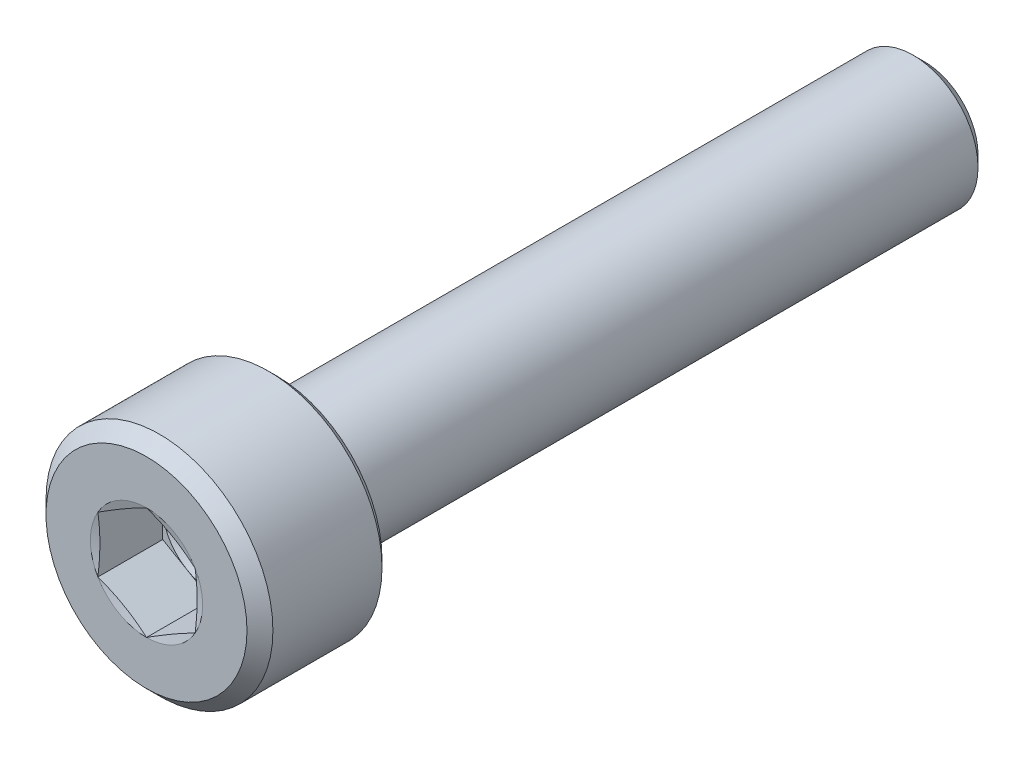
ISO-10303-21;
HEADER;
FILE_DESCRIPTION(('STEP AP214'),'2;1');
FILE_NAME('part.step','',(''),(''),'','','');
FILE_SCHEMA(('AUTOMOTIVE_DESIGN { 1 0 10303 214 1 1 1 1 }'));
ENDSEC;
DATA;
#1=APPLICATION_CONTEXT('core data for automotive mechanical design processes');
#2=APPLICATION_PROTOCOL_DEFINITION('international standard','automotive_design',2000,#1);
#3=PRODUCT_CONTEXT('',#1,'mechanical');
#4=PRODUCT('Part','Part','',(#3));
#5=PRODUCT_RELATED_PRODUCT_CATEGORY('part','',(#4));
#6=PRODUCT_DEFINITION_FORMATION('','',#4);
#7=PRODUCT_DEFINITION_CONTEXT('part definition',#1,'design');
#8=PRODUCT_DEFINITION('design','',#6,#7);
#9=PRODUCT_DEFINITION_SHAPE('','',#8);
#10=(LENGTH_UNIT() NAMED_UNIT(*) SI_UNIT(.MILLI.,.METRE.));
#11=(NAMED_UNIT(*) PLANE_ANGLE_UNIT() SI_UNIT($,.RADIAN.));
#12=(NAMED_UNIT(*) SI_UNIT($,.STERADIAN.) SOLID_ANGLE_UNIT());
#13=UNCERTAINTY_MEASURE_WITH_UNIT(LENGTH_MEASURE(1.E-05),#10,'distance_accuracy_value','');
#14=(GEOMETRIC_REPRESENTATION_CONTEXT(3) GLOBAL_UNCERTAINTY_ASSIGNED_CONTEXT((#13)) GLOBAL_UNIT_ASSIGNED_CONTEXT((#10,
#11,#12)) REPRESENTATION_CONTEXT('',''));
#15=CARTESIAN_POINT('',(0.,0.,0.));
#16=DIRECTION('',(0.,0.,1.));
#17=DIRECTION('',(1.,0.,0.));
#18=AXIS2_PLACEMENT_3D('',#15,#16,#17);
#19=CARTESIAN_POINT('',(0.,0.,0.));
#20=DIRECTION('',(0.,0.,-1.));
#21=DIRECTION('',(-1.,0.,0.));
#22=AXIS2_PLACEMENT_3D('',#19,#20,#21);
#23=PLANE('',#22);
#24=CARTESIAN_POINT('',(0.,0.,0.));
#25=DIRECTION('',(0.,0.,1.));
#26=DIRECTION('',(1.,0.,0.));
#27=AXIS2_PLACEMENT_3D('',#24,#25,#26);
#28=CIRCLE('',#27,3.1);
#29=CARTESIAN_POINT('',(3.1,0.,0.));
#30=VERTEX_POINT('',#29);
#31=EDGE_CURVE('E229',#30,#30,#28,.T.);
#32=ORIENTED_EDGE('',*,*,#31,.T.);
#33=EDGE_LOOP('',(#32));
#34=FACE_BOUND('',#33,.T.);
#35=CARTESIAN_POINT('',(0.,0.,0.));
#36=DIRECTION('',(0.,0.,1.));
#37=DIRECTION('',(1.,0.,0.));
#38=AXIS2_PLACEMENT_3D('',#35,#36,#37);
#39=CIRCLE('',#38,1.73205080756888);
#40=CARTESIAN_POINT('',(-1.5,-0.866025403784441,0.));
#41=VERTEX_POINT('',#40);
#42=CARTESIAN_POINT('',(0.,-1.73205080756888,0.));
#43=VERTEX_POINT('',#42);
#44=EDGE_CURVE('E155',#41,#43,#39,.T.);
#45=ORIENTED_EDGE('',*,*,#44,.F.);
#46=CARTESIAN_POINT('',(-1.5,0.86602540378444,0.));
#47=VERTEX_POINT('',#46);
#48=EDGE_CURVE('E154',#47,#41,#39,.T.);
#49=ORIENTED_EDGE('',*,*,#48,.F.);
#50=CARTESIAN_POINT('',(0.,1.73205080756888,0.));
#51=VERTEX_POINT('',#50);
#52=EDGE_CURVE('E121',#51,#47,#39,.T.);
#53=ORIENTED_EDGE('',*,*,#52,.F.);
#54=CARTESIAN_POINT('',(1.5,0.86602540378444,0.));
#55=VERTEX_POINT('',#54);
#56=EDGE_CURVE('E115',#55,#51,#39,.T.);
#57=ORIENTED_EDGE('',*,*,#56,.F.);
#58=CARTESIAN_POINT('',(1.5,-0.866025403784438,0.));
#59=VERTEX_POINT('',#58);
#60=EDGE_CURVE('E123',#59,#55,#39,.T.);
#61=ORIENTED_EDGE('',*,*,#60,.F.);
#62=EDGE_CURVE('E313',#43,#59,#39,.T.);
#63=ORIENTED_EDGE('',*,*,#62,.F.);
#64=EDGE_LOOP('',(#45,#49,#53,#57,#61,#63));
#65=FACE_BOUND('',#64,.T.);
#66=ADVANCED_FACE('F38',(#34,#65),#23,.F.);
#67=CARTESIAN_POINT('',(0.,0.,-0.4));
#68=DIRECTION('',(0.,0.,-1.));
#69=DIRECTION('',(-1.,0.,0.));
#70=AXIS2_PLACEMENT_3D('',#67,#68,#69);
#71=CONICAL_SURFACE('',#70,3.5,0.78539816339745);
#72=ORIENTED_EDGE('',*,*,#31,.F.);
#73=EDGE_LOOP('',(#72));
#74=FACE_BOUND('',#73,.T.);
#75=CARTESIAN_POINT('',(0.,0.,-0.4));
#76=DIRECTION('',(0.,0.,1.));
#77=DIRECTION('',(1.,0.,0.));
#78=AXIS2_PLACEMENT_3D('',#75,#76,#77);
#79=CIRCLE('',#78,3.5);
#80=CARTESIAN_POINT('',(3.5,0.,-0.4));
#81=VERTEX_POINT('',#80);
#82=EDGE_CURVE('E231',#81,#81,#79,.T.);
#83=ORIENTED_EDGE('',*,*,#82,.T.);
#84=EDGE_LOOP('',(#83));
#85=FACE_BOUND('',#84,.T.);
#86=ADVANCED_FACE('F220',(#74,#85),#71,.T.);
#87=CARTESIAN_POINT('',(0.,0.,0.));
#88=DIRECTION('',(0.,0.,1.));
#89=DIRECTION('',(1.,0.,0.));
#90=AXIS2_PLACEMENT_3D('',#87,#88,#89);
#91=CYLINDRICAL_SURFACE('',#90,3.5);
#92=ORIENTED_EDGE('',*,*,#82,.F.);
#93=EDGE_LOOP('',(#92));
#94=FACE_BOUND('',#93,.T.);
#95=CARTESIAN_POINT('',(0.,0.,-3.765));
#96=DIRECTION('',(0.,0.,1.));
#97=DIRECTION('',(1.,0.,0.));
#98=AXIS2_PLACEMENT_3D('',#95,#96,#97);
#99=CIRCLE('',#98,3.5);
#100=CARTESIAN_POINT('',(3.5,0.,-3.765));
#101=VERTEX_POINT('',#100);
#102=EDGE_CURVE('E234',#101,#101,#99,.T.);
#103=ORIENTED_EDGE('',*,*,#102,.T.);
#104=EDGE_LOOP('',(#103));
#105=FACE_BOUND('',#104,.T.);
#106=ADVANCED_FACE('F225',(#94,#105),#91,.T.);
#107=CARTESIAN_POINT('',(0.,0.,-4.));
#108=DIRECTION('',(0.,0.,1.));
#109=DIRECTION('',(1.,0.,0.));
#110=AXIS2_PLACEMENT_3D('',#107,#108,#109);
#111=CONICAL_SURFACE('',#110,3.265,0.78539816339745);
#112=ORIENTED_EDGE('',*,*,#102,.F.);
#113=EDGE_LOOP('',(#112));
#114=FACE_BOUND('',#113,.T.);
#115=CARTESIAN_POINT('',(0.,0.,-4.));
#116=DIRECTION('',(0.,0.,1.));
#117=DIRECTION('',(1.,0.,0.));
#118=AXIS2_PLACEMENT_3D('',#115,#116,#117);
#119=CIRCLE('',#118,3.265);
#120=CARTESIAN_POINT('',(3.265,0.,-4.));
#121=VERTEX_POINT('',#120);
#122=EDGE_CURVE('E239',#121,#121,#119,.T.);
#123=ORIENTED_EDGE('',*,*,#122,.T.);
#124=EDGE_LOOP('',(#123));
#125=FACE_BOUND('',#124,.T.);
#126=ADVANCED_FACE('F429',(#114,#125),#111,.T.);
#127=CARTESIAN_POINT('',(0.,3.265,-4.));
#128=DIRECTION('',(0.,0.,1.));
#129=DIRECTION('',(1.,0.,0.));
#130=AXIS2_PLACEMENT_3D('',#127,#128,#129);
#131=PLANE('',#130);
#132=ORIENTED_EDGE('',*,*,#122,.F.);
#133=EDGE_LOOP('',(#132));
#134=FACE_BOUND('',#133,.T.);
#135=CARTESIAN_POINT('',(0.,0.,-4.));
#136=DIRECTION('',(0.,0.,1.));
#137=DIRECTION('',(1.,0.,0.));
#138=AXIS2_PLACEMENT_3D('',#135,#136,#137);
#139=CIRCLE('',#138,2.35);
#140=CARTESIAN_POINT('',(2.35,0.,-4.));
#141=VERTEX_POINT('',#140);
#142=EDGE_CURVE('E242',#141,#141,#139,.T.);
#143=ORIENTED_EDGE('',*,*,#142,.T.);
#144=EDGE_LOOP('',(#143));
#145=FACE_BOUND('',#144,.T.);
#146=ADVANCED_FACE('F421',(#134,#145),#131,.F.);
#147=CARTESIAN_POINT('',(0.,0.,-4.2));
#148=DIRECTION('',(0.,0.,1.));
#149=DIRECTION('',(1.,0.,0.));
#150=AXIS2_PLACEMENT_3D('',#147,#148,#149);
#151=TOROIDAL_SURFACE('',#150,2.35,0.199999999999999);
#152=ORIENTED_EDGE('',*,*,#142,.F.);
#153=EDGE_LOOP('',(#152));
#154=FACE_BOUND('',#153,.T.);
#155=CARTESIAN_POINT('',(0.,0.,-4.12977531168232));
#156=DIRECTION('',(0.,0.,1.));
#157=DIRECTION('',(1.,0.,0.));
#158=AXIS2_PLACEMENT_3D('',#155,#156,#157);
#159=CIRCLE('',#158,2.16273416448619);
#160=CARTESIAN_POINT('',(2.16273416448619,0.,-4.12977531168232));
#161=VERTEX_POINT('',#160);
#162=EDGE_CURVE('E245',#161,#161,#159,.T.);
#163=ORIENTED_EDGE('',*,*,#162,.T.);
#164=EDGE_LOOP('',(#163));
#165=FACE_BOUND('',#164,.T.);
#166=ADVANCED_FACE('F413',(#154,#165),#151,.F.);
#167=CARTESIAN_POINT('',(0.,0.,-4.52977531168232));
#168=DIRECTION('',(0.,0.,1.));
#169=DIRECTION('',(1.,0.,0.));
#170=AXIS2_PLACEMENT_3D('',#167,#168,#169);
#171=CONICAL_SURFACE('',#170,2.01273416448619,0.358770670270571);
#172=ORIENTED_EDGE('',*,*,#162,.F.);
#173=EDGE_LOOP('',(#172));
#174=FACE_BOUND('',#173,.T.);
#175=CARTESIAN_POINT('',(0.,0.,-4.52977531168232));
#176=DIRECTION('',(0.,0.,1.));
#177=DIRECTION('',(1.,0.,0.));
#178=AXIS2_PLACEMENT_3D('',#175,#176,#177);
#179=CIRCLE('',#178,2.01273416448619);
#180=CARTESIAN_POINT('',(2.01273416448619,0.,-4.52977531168232));
#181=VERTEX_POINT('',#180);
#182=EDGE_CURVE('E248',#181,#181,#179,.T.);
#183=ORIENTED_EDGE('',*,*,#182,.T.);
#184=EDGE_LOOP('',(#183));
#185=FACE_BOUND('',#184,.T.);
#186=ADVANCED_FACE('F405',(#174,#185),#171,.T.);
#187=CARTESIAN_POINT('',(0.,0.,-4.6));
#188=DIRECTION('',(0.,0.,1.));
#189=DIRECTION('',(1.,0.,0.));
#190=AXIS2_PLACEMENT_3D('',#187,#188,#189);
#191=TOROIDAL_SURFACE('',#190,2.2,0.199999999999999);
#192=ORIENTED_EDGE('',*,*,#182,.F.);
#193=EDGE_LOOP('',(#192));
#194=FACE_BOUND('',#193,.T.);
#195=CARTESIAN_POINT('',(0.,0.,-4.6));
#196=DIRECTION('',(0.,0.,1.));
#197=DIRECTION('',(1.,0.,0.));
#198=AXIS2_PLACEMENT_3D('',#195,#196,#197);
#199=CIRCLE('',#198,2.);
#200=CARTESIAN_POINT('',(2.,0.,-4.6));
#201=VERTEX_POINT('',#200);
#202=EDGE_CURVE('E251',#201,#201,#199,.T.);
#203=ORIENTED_EDGE('',*,*,#202,.T.);
#204=EDGE_LOOP('',(#203));
#205=FACE_BOUND('',#204,.T.);
#206=ADVANCED_FACE('F397',(#194,#205),#191,.F.);
#207=CARTESIAN_POINT('',(0.,0.,0.));
#208=DIRECTION('',(0.,0.,1.));
#209=DIRECTION('',(1.,0.,0.));
#210=AXIS2_PLACEMENT_3D('',#207,#208,#209);
#211=CYLINDRICAL_SURFACE('',#210,2.);
#212=ORIENTED_EDGE('',*,*,#202,.F.);
#213=EDGE_LOOP('',(#212));
#214=FACE_BOUND('',#213,.T.);
#215=CARTESIAN_POINT('',(0.,0.,-23.65));
#216=DIRECTION('',(0.,0.,1.));
#217=DIRECTION('',(1.,0.,0.));
#218=AXIS2_PLACEMENT_3D('',#215,#216,#217);
#219=CIRCLE('',#218,2.);
#220=CARTESIAN_POINT('',(2.,0.,-23.65));
#221=VERTEX_POINT('',#220);
#222=EDGE_CURVE('E254',#221,#221,#219,.T.);
#223=ORIENTED_EDGE('',*,*,#222,.T.);
#224=EDGE_LOOP('',(#223));
#225=FACE_BOUND('',#224,.T.);
#226=ADVANCED_FACE('F388',(#214,#225),#211,.T.);
#227=CARTESIAN_POINT('',(0.,0.,-24.));
#228=DIRECTION('',(0.,0.,1.));
#229=DIRECTION('',(1.,0.,0.));
#230=AXIS2_PLACEMENT_3D('',#227,#228,#229);
#231=CONICAL_SURFACE('',#230,1.65,0.785398163397429);
#232=ORIENTED_EDGE('',*,*,#222,.F.);
#233=EDGE_LOOP('',(#232));
#234=FACE_BOUND('',#233,.T.);
#235=CARTESIAN_POINT('',(0.,0.,-24.));
#236=DIRECTION('',(0.,0.,1.));
#237=DIRECTION('',(1.,0.,0.));
#238=AXIS2_PLACEMENT_3D('',#235,#236,#237);
#239=CIRCLE('',#238,1.65);
#240=CARTESIAN_POINT('',(1.65,0.,-24.));
#241=VERTEX_POINT('',#240);
#242=EDGE_CURVE('E257',#241,#241,#239,.T.);
#243=ORIENTED_EDGE('',*,*,#242,.T.);
#244=EDGE_LOOP('',(#243));
#245=FACE_BOUND('',#244,.T.);
#246=ADVANCED_FACE('F380',(#234,#245),#231,.T.);
#247=CARTESIAN_POINT('',(0.,1.65,-24.));
#248=DIRECTION('',(0.,0.,1.));
#249=DIRECTION('',(1.,0.,0.));
#250=AXIS2_PLACEMENT_3D('',#247,#248,#249);
#251=PLANE('',#250);
#252=ORIENTED_EDGE('',*,*,#242,.F.);
#253=EDGE_LOOP('',(#252));
#254=FACE_BOUND('',#253,.T.);
#255=ADVANCED_FACE('F374',(#254),#251,.F.);
#256=CARTESIAN_POINT('',(0.,0.,-0.0621778264910692));
#257=DIRECTION('',(0.,0.,1.));
#258=DIRECTION('',(1.,0.,0.));
#259=AXIS2_PLACEMENT_3D('',#256,#257,#258);
#260=CONICAL_SURFACE('',#259,1.5,1.30899693899575);
#261=ORIENTED_EDGE('',*,*,#52,.T.);
#262=CARTESIAN_POINT('',(-1.5002,0.865909933730602,3.09432014802828E-05));
#263=CARTESIAN_POINT('',(-1.43789222061942,0.901883346928587,-0.00961367357160753));
#264=CARTESIAN_POINT('',(-1.37547144481682,0.937921998641243,-0.0183695040280942));
#265=CARTESIAN_POINT('',(-1.25040937601299,1.01012661773055,-0.0337528099860755));
#266=CARTESIAN_POINT('',(-1.18776800380528,1.04629263083708,-0.0403794203637019));
#267=CARTESIAN_POINT('',(-1.06264466889024,1.11853262193218,-0.0511173105510228));
#268=CARTESIAN_POINT('',(-1.00016355288116,1.15460611107929,-0.0552413999954297));
#269=CARTESIAN_POINT('',(-0.875121612727221,1.22679910888716,-0.0607713948192355));
#270=CARTESIAN_POINT('',(-0.81256080636361,1.26291860728191,-0.0621778264910689));
#271=CARTESIAN_POINT('',(-0.687439193636389,1.33515760407141,-0.0621778264910689));
#272=CARTESIAN_POINT('',(-0.624878387272779,1.37127710246616,-0.0607713948192355));
#273=CARTESIAN_POINT('',(-0.499836447118839,1.44347010027403,-0.0552413999954297));
#274=CARTESIAN_POINT('',(-0.437355331109757,1.47954358942114,-0.0511173105510227));
#275=CARTESIAN_POINT('',(-0.312231996194721,1.55178358051624,-0.0403794203637018));
#276=CARTESIAN_POINT('',(-0.249590623987014,1.58794959362277,-0.0337528099860754));
#277=CARTESIAN_POINT('',(-0.124528555183177,1.66015421271208,-0.0183695040280941));
#278=CARTESIAN_POINT('',(-0.0621077793805777,1.69619286442473,-0.00961367357160735));
#279=CARTESIAN_POINT('',(0.000200000000000538,1.73216627762272,3.09432014804724E-05));
#280=B_SPLINE_CURVE_WITH_KNOTS('',3,(#262,#263,#264,#265,#266,#267,#268,#269,#270,#271,#272,
#273,#274,#275,#276,#277,#278,#279),.UNSPECIFIED.,.F.,.F.,(4,2,2,2,2,2,2,2,4),(0.,
0.217782584290281,0.435653544301782,0.652399669875338,0.869103816917188,1.08580796395904,
1.30255408953259,1.52042504954409,1.73820763383438),.UNSPECIFIED.);
#281=EDGE_CURVE('E11',#47,#51,#280,.T.);
#282=ORIENTED_EDGE('',*,*,#281,.T.);
#283=EDGE_LOOP('',(#261,#282));
#284=FACE_BOUND('',#283,.T.);
#285=ADVANCED_FACE('F127',(#284),#260,.F.);
#286=CARTESIAN_POINT('',(-1.5,-2.28964517247226,0.269339250493358));
#287=CARTESIAN_POINT('',(-1.5,-2.22160925580753,0.254092485074887));
#288=CARTESIAN_POINT('',(-1.5,-2.15353089636947,0.239034964401491));
#289=CARTESIAN_POINT('',(-1.5,-2.01726808230002,0.209394014326251));
#290=CARTESIAN_POINT('',(-1.5,-1.94908362321089,0.194810605440343));
#291=CARTESIAN_POINT('',(-1.5,-1.74421629402713,0.15188930467263));
#292=CARTESIAN_POINT('',(-1.5,-1.60735081315243,0.124410160848443));
#293=CARTESIAN_POINT('',(-1.5,-1.33404872260703,0.0731505368877311));
#294=CARTESIAN_POINT('',(-1.5,-1.19761743420633,0.0493422393460058));
#295=CARTESIAN_POINT('',(-1.5,-0.923938172131804,0.00699912407182039));
#296=CARTESIAN_POINT('',(-1.5,-0.786690344875856,-0.0115366116465929));
#297=CARTESIAN_POINT('',(-1.5,-0.509744520865001,-0.0409708681025398));
#298=CARTESIAN_POINT('',(-1.5,-0.370036362636702,-0.0517807181835124));
#299=CARTESIAN_POINT('',(-1.5,-0.160199252563518,-0.0603214648098066));
#300=CARTESIAN_POINT('',(-1.5,-0.0902193139362214,-0.0618897497676771));
#301=CARTESIAN_POINT('',(-1.5,0.049751791494376,-0.0623927733659913));
#302=CARTESIAN_POINT('',(-1.5,0.119742958288953,-0.0613275140426648));
#303=CARTESIAN_POINT('',(-1.5,0.259888881116302,-0.0566175514896631));
#304=CARTESIAN_POINT('',(-1.5,0.330043318264885,-0.0529635706300794));
#305=CARTESIAN_POINT('',(-1.5,0.470190940626507,-0.0432854694959674));
#306=CARTESIAN_POINT('',(-1.5,0.540184111252621,-0.0372611426780542));
#307=CARTESIAN_POINT('',(-1.5,0.749926987666925,-0.0160904435214203));
#308=CARTESIAN_POINT('',(-1.5,0.88936353865627,0.0021504551344671));
#309=CARTESIAN_POINT('',(-1.5,1.15801626262229,0.042848348608772));
#310=CARTESIAN_POINT('',(-1.5,1.28729075030016,0.0649405727898832));
#311=CARTESIAN_POINT('',(-1.5,1.54524807848696,0.11239508941207));
#312=CARTESIAN_POINT('',(-1.5,1.67393084218421,0.137757794638382));
#313=CARTESIAN_POINT('',(-1.5,1.9308654649173,0.190676592918979));
#314=CARTESIAN_POINT('',(-1.5,2.05911723183815,0.218233127195528));
#315=CARTESIAN_POINT('',(-1.5,2.31529096225887,0.274842718879562));
#316=CARTESIAN_POINT('',(-1.5,2.44321291887911,0.303895807243219));
#317=CARTESIAN_POINT('',(-1.5,2.69755167278246,0.362760576516848));
#318=CARTESIAN_POINT('',(-1.5,2.82397086776101,0.392561944472507));
#319=CARTESIAN_POINT('',(-1.5,3.07663292781285,0.452911245733353));
#320=CARTESIAN_POINT('',(-1.5,3.20287578964328,0.483459192582276));
#321=CARTESIAN_POINT('',(-1.5,3.45507130559321,0.545068721241145));
#322=CARTESIAN_POINT('',(-1.5,3.58102412567918,0.576129625174751));
#323=CARTESIAN_POINT('',(-1.5,3.83282000513678,0.638675885363819));
#324=CARTESIAN_POINT('',(-1.5,3.95866306798554,0.670161227611327));
#325=CARTESIAN_POINT('',(-1.5,4.08446786908827,0.70179695066207));
#326=B_SPLINE_CURVE_WITH_KNOTS('',3,(#286,#287,#288,#289,#290,#291,#292,#293,#294,#295,#296,
#297,#298,#299,#300,#301,#302,#303,#304,#305,#306,#307,#308,#309,#310,#311,#312,#313,#314,#315,
#316,#317,#318,#319,#320,#321,#322,#323,#324,#325),.UNSPECIFIED.,.F.,.F.,(4,2,2,2,2,2,2,2,2,2,2,
2,2,2,2,2,2,2,2,4),(0.,0.209169579296721,0.418348197839629,0.837109447697196,1.25252230864062,
1.66786279927901,2.08789680755374,2.29784449547574,2.50779202106835,2.71849580165408,
2.92921794627363,3.35089158040197,3.74428720392395,4.13773252874107,4.53125718404496,
4.92478998266471,5.31443997631384,5.70409704388357,6.09327490648975,6.48243995615359),.UNSPECIFIED.);
#327=EDGE_CURVE('E120',#41,#47,#326,.T.);
#328=ORIENTED_EDGE('',*,*,#327,.T.);
#329=ORIENTED_EDGE('',*,*,#48,.T.);
#330=EDGE_LOOP('',(#328,#329));
#331=FACE_BOUND('',#330,.T.);
#332=ADVANCED_FACE('F361',(#331),#260,.F.);
#333=CARTESIAN_POINT('',(0.000199999999999819,-1.73216627762271,3.09432014800229E-05));
#334=CARTESIAN_POINT('',(-0.0621077793805785,-1.69619286442473,-0.00961367357160781));
#335=CARTESIAN_POINT('',(-0.124528555183178,-1.66015421271207,-0.0183695040280945));
#336=CARTESIAN_POINT('',(-0.249590623987014,-1.58794959362277,-0.0337528099860759));
#337=CARTESIAN_POINT('',(-0.312231996194721,-1.55178358051624,-0.0403794203637023));
#338=CARTESIAN_POINT('',(-0.437355331109758,-1.47954358942114,-0.0511173105510232));
#339=CARTESIAN_POINT('',(-0.499836447118839,-1.44347010027403,-0.0552413999954301));
#340=CARTESIAN_POINT('',(-0.624878387272779,-1.37127710246616,-0.0607713948192359));
#341=CARTESIAN_POINT('',(-0.68743919363639,-1.33515760407141,-0.0621778264910694));
#342=CARTESIAN_POINT('',(-0.81256080636361,-1.26291860728191,-0.0621778264910694));
#343=CARTESIAN_POINT('',(-0.875121612727221,-1.22679910888716,-0.0607713948192359));
#344=CARTESIAN_POINT('',(-1.00016355288116,-1.15460611107929,-0.0552413999954301));
#345=CARTESIAN_POINT('',(-1.06264466889024,-1.11853262193217,-0.0511173105510231));
#346=CARTESIAN_POINT('',(-1.18776800380528,-1.04629263083707,-0.0403794203637023));
#347=CARTESIAN_POINT('',(-1.25040937601299,-1.01012661773055,-0.0337528099860759));
#348=CARTESIAN_POINT('',(-1.37547144481682,-0.937921998641241,-0.0183695040280945));
#349=CARTESIAN_POINT('',(-1.43789222061942,-0.901883346928585,-0.00961367357160784));
#350=CARTESIAN_POINT('',(-1.5002,-0.8659099337306,3.09432014799995E-05));
#351=B_SPLINE_CURVE_WITH_KNOTS('',3,(#333,#334,#335,#336,#337,#338,#339,#340,#341,#342,#343,
#344,#345,#346,#347,#348,#349,#350),.UNSPECIFIED.,.F.,.F.,(4,2,2,2,2,2,2,2,4),(0.,
0.217782584290281,0.435653544301782,0.652399669875338,0.869103816917187,1.08580796395904,
1.30255408953259,1.52042504954409,1.73820763383437),.UNSPECIFIED.);
#352=EDGE_CURVE('E163',#43,#41,#351,.T.);
#353=ORIENTED_EDGE('',*,*,#352,.T.);
#354=ORIENTED_EDGE('',*,*,#44,.T.);
#355=EDGE_LOOP('',(#353,#354));
#356=FACE_BOUND('',#355,.T.);
#357=ADVANCED_FACE('F355',(#356),#260,.F.);
#358=CARTESIAN_POINT('',(1.5002,-0.865909933730601,3.09432014800545E-05));
#359=CARTESIAN_POINT('',(1.43789222061942,-0.901883346928586,-0.00961367357160779));
#360=CARTESIAN_POINT('',(1.37547144481682,-0.937921998641241,-0.0183695040280945));
#361=CARTESIAN_POINT('',(1.25040937601299,-1.01012661773055,-0.0337528099860758));
#362=CARTESIAN_POINT('',(1.18776800380528,-1.04629263083708,-0.0403794203637023));
#363=CARTESIAN_POINT('',(1.06264466889024,-1.11853262193217,-0.0511173105510231));
#364=CARTESIAN_POINT('',(1.00016355288116,-1.15460611107929,-0.0552413999954301));
#365=CARTESIAN_POINT('',(0.875121612727221,-1.22679910888716,-0.0607713948192359));
#366=CARTESIAN_POINT('',(0.81256080636361,-1.26291860728191,-0.0621778264910693));
#367=CARTESIAN_POINT('',(0.687439193636389,-1.33515760407141,-0.0621778264910693));
#368=CARTESIAN_POINT('',(0.624878387272779,-1.37127710246616,-0.0607713948192359));
#369=CARTESIAN_POINT('',(0.499836447118839,-1.44347010027403,-0.0552413999954301));
#370=CARTESIAN_POINT('',(0.437355331109758,-1.47954358942114,-0.0511173105510231));
#371=CARTESIAN_POINT('',(0.312231996194721,-1.55178358051624,-0.0403794203637023));
#372=CARTESIAN_POINT('',(0.249590623987014,-1.58794959362277,-0.0337528099860758));
#373=CARTESIAN_POINT('',(0.124528555183178,-1.66015421271207,-0.0183695040280946));
#374=CARTESIAN_POINT('',(0.0621077793805782,-1.69619286442473,-0.00961367357160789));
#375=CARTESIAN_POINT('',(-0.000200000000000048,-1.73216627762271,3.09432014798939E-05));
#376=B_SPLINE_CURVE_WITH_KNOTS('',3,(#358,#359,#360,#361,#362,#363,#364,#365,#366,#367,#368,
#369,#370,#371,#372,#373,#374,#375),.UNSPECIFIED.,.F.,.F.,(4,2,2,2,2,2,2,2,4),(0.,
0.217782584290281,0.435653544301782,0.652399669875337,0.869103816917187,1.08580796395904,
1.30255408953259,1.52042504954409,1.73820763383437),.UNSPECIFIED.);
#377=EDGE_CURVE('E183',#59,#43,#376,.T.);
#378=ORIENTED_EDGE('',*,*,#377,.T.);
#379=ORIENTED_EDGE('',*,*,#62,.T.);
#380=EDGE_LOOP('',(#378,#379));
#381=FACE_BOUND('',#380,.T.);
#382=ADVANCED_FACE('F349',(#381),#260,.F.);
#383=CARTESIAN_POINT('',(1.5,-2.28964517247227,0.269339250493358));
#384=CARTESIAN_POINT('',(1.5,-2.22160925580753,0.254092485074887));
#385=CARTESIAN_POINT('',(1.5,-2.15353089636947,0.239034964401491));
#386=CARTESIAN_POINT('',(1.5,-2.01726808230003,0.209394014326251));
#387=CARTESIAN_POINT('',(1.5,-1.94908362321089,0.194810605440343));
#388=CARTESIAN_POINT('',(1.5,-1.74421629402713,0.15188930467263));
#389=CARTESIAN_POINT('',(1.5,-1.60735081315243,0.124410160848443));
#390=CARTESIAN_POINT('',(1.5,-1.33404872260703,0.0731505368877311));
#391=CARTESIAN_POINT('',(1.5,-1.19761743420633,0.0493422393460058));
#392=CARTESIAN_POINT('',(1.5,-0.923938172131805,0.00699912407182037));
#393=CARTESIAN_POINT('',(1.5,-0.786690344875857,-0.0115366116465929));
#394=CARTESIAN_POINT('',(1.5,-0.509744520865002,-0.0409708681025397));
#395=CARTESIAN_POINT('',(1.5,-0.370036362636703,-0.0517807181835124));
#396=CARTESIAN_POINT('',(1.5,-0.160199252563519,-0.0603214648098066));
#397=CARTESIAN_POINT('',(1.5,-0.0902193139362225,-0.0618897497676772));
#398=CARTESIAN_POINT('',(1.5,0.049751791494375,-0.0623927733659914));
#399=CARTESIAN_POINT('',(1.5,0.119742958288952,-0.0613275140426649));
#400=CARTESIAN_POINT('',(1.5,0.259888881116301,-0.0566175514896632));
#401=CARTESIAN_POINT('',(1.5,0.330043318264884,-0.0529635706300795));
#402=CARTESIAN_POINT('',(1.5,0.470190940626506,-0.0432854694959675));
#403=CARTESIAN_POINT('',(1.5,0.54018411125262,-0.0372611426780543));
#404=CARTESIAN_POINT('',(1.5,0.749926987666924,-0.0160904435214204));
#405=CARTESIAN_POINT('',(1.5,0.889363538656269,0.00215045513446702));
#406=CARTESIAN_POINT('',(1.5,1.15801626262229,0.0428483486087719));
#407=CARTESIAN_POINT('',(1.5,1.28729075030016,0.0649405727898832));
#408=CARTESIAN_POINT('',(1.5,1.54524807848696,0.11239508941207));
#409=CARTESIAN_POINT('',(1.5,1.67393084218421,0.137757794638382));
#410=CARTESIAN_POINT('',(1.5,1.9308654649173,0.19067659291898));
#411=CARTESIAN_POINT('',(1.5,2.05911723183815,0.218233127195528));
#412=CARTESIAN_POINT('',(1.5,2.31529096225887,0.274842718879562));
#413=CARTESIAN_POINT('',(1.5,2.44321291887912,0.303895807243219));
#414=CARTESIAN_POINT('',(1.5,2.69755167278246,0.362760576516849));
#415=CARTESIAN_POINT('',(1.5,2.82397086776101,0.392561944472508));
#416=CARTESIAN_POINT('',(1.5,3.07663292781285,0.452911245733354));
#417=CARTESIAN_POINT('',(1.5,3.20287578964328,0.483459192582276));
#418=CARTESIAN_POINT('',(1.5,3.45507130559321,0.545068721241145));
#419=CARTESIAN_POINT('',(1.5,3.58102412567918,0.576129625174751));
#420=CARTESIAN_POINT('',(1.5,3.83282000513678,0.63867588536382));
#421=CARTESIAN_POINT('',(1.5,3.95866306798554,0.670161227611328));
#422=CARTESIAN_POINT('',(1.5,4.08446786908828,0.70179695066207));
#423=B_SPLINE_CURVE_WITH_KNOTS('',3,(#383,#384,#385,#386,#387,#388,#389,#390,#391,#392,#393,
#394,#395,#396,#397,#398,#399,#400,#401,#402,#403,#404,#405,#406,#407,#408,#409,#410,#411,#412,
#413,#414,#415,#416,#417,#418,#419,#420,#421,#422),.UNSPECIFIED.,.F.,.F.,(4,2,2,2,2,2,2,2,2,2,2,
2,2,2,2,2,2,2,2,4),(0.,0.209169579296721,0.418348197839629,0.837109447697197,1.25252230864062,
1.66786279927901,2.08789680755374,2.29784449547574,2.50779202106835,2.71849580165408,
2.92921794627363,3.35089158040197,3.74428720392395,4.13773252874107,4.53125718404496,
4.92478998266471,5.31443997631385,5.70409704388357,6.09327490648975,6.48243995615359),.UNSPECIFIED.);
#424=EDGE_CURVE('E63',#55,#59,#423,.F.);
#425=ORIENTED_EDGE('',*,*,#424,.T.);
#426=ORIENTED_EDGE('',*,*,#60,.T.);
#427=EDGE_LOOP('',(#425,#426));
#428=FACE_BOUND('',#427,.T.);
#429=ADVANCED_FACE('F176',(#428),#260,.F.);
#430=CARTESIAN_POINT('',(-0.000199999999999667,1.73216627762272,3.09432014804973E-05));
#431=CARTESIAN_POINT('',(0.0621077793805787,1.69619286442473,-0.0096136735716074));
#432=CARTESIAN_POINT('',(0.124528555183178,1.66015421271208,-0.0183695040280941));
#433=CARTESIAN_POINT('',(0.249590623987014,1.58794959362277,-0.0337528099860754));
#434=CARTESIAN_POINT('',(0.312231996194721,1.55178358051624,-0.0403794203637018));
#435=CARTESIAN_POINT('',(0.437355331109758,1.47954358942114,-0.0511173105510226));
#436=CARTESIAN_POINT('',(0.499836447118839,1.44347010027403,-0.0552413999954297));
#437=CARTESIAN_POINT('',(0.624878387272779,1.37127710246616,-0.0607713948192354));
#438=CARTESIAN_POINT('',(0.68743919363639,1.33515760407141,-0.0621778264910688));
#439=CARTESIAN_POINT('',(0.812560806363611,1.26291860728191,-0.0621778264910688));
#440=CARTESIAN_POINT('',(0.875121612727221,1.22679910888716,-0.0607713948192354));
#441=CARTESIAN_POINT('',(1.00016355288116,1.15460611107929,-0.0552413999954297));
#442=CARTESIAN_POINT('',(1.06264466889024,1.11853262193218,-0.0511173105510227));
#443=CARTESIAN_POINT('',(1.18776800380528,1.04629263083708,-0.0403794203637019));
#444=CARTESIAN_POINT('',(1.25040937601299,1.01012661773055,-0.0337528099860755));
#445=CARTESIAN_POINT('',(1.37547144481682,0.937921998641243,-0.0183695040280941));
#446=CARTESIAN_POINT('',(1.43789222061942,0.901883346928587,-0.00961367357160743));
#447=CARTESIAN_POINT('',(1.5002,0.865909933730602,3.09432014803357E-05));
#448=B_SPLINE_CURVE_WITH_KNOTS('',3,(#430,#431,#432,#433,#434,#435,#436,#437,#438,#439,#440,
#441,#442,#443,#444,#445,#446,#447),.UNSPECIFIED.,.F.,.F.,(4,2,2,2,2,2,2,2,4),(0.,
0.217782584290281,0.435653544301782,0.652399669875338,0.869103816917187,1.08580796395904,
1.30255408953259,1.52042504954409,1.73820763383437),.UNSPECIFIED.);
#449=EDGE_CURVE('E57',#51,#55,#448,.T.);
#450=ORIENTED_EDGE('',*,*,#449,.T.);
#451=ORIENTED_EDGE('',*,*,#56,.T.);
#452=EDGE_LOOP('',(#450,#451));
#453=FACE_BOUND('',#452,.T.);
#454=ADVANCED_FACE('F116',(#453),#260,.F.);
#455=CARTESIAN_POINT('',(0.,0.,-2.86602540378443));
#456=DIRECTION('',(0.,0.,1.));
#457=DIRECTION('',(1.,0.,0.));
#458=AXIS2_PLACEMENT_3D('',#455,#456,#457);
#459=CONICAL_SURFACE('',#458,0.,1.0471975511966);
#460=CARTESIAN_POINT('',(0.,0.,-2.));
#461=DIRECTION('',(0.,0.,1.));
#462=DIRECTION('',(1.,0.,0.));
#463=AXIS2_PLACEMENT_3D('',#460,#461,#462);
#464=CIRCLE('',#463,1.5);
#465=CARTESIAN_POINT('',(1.5,0.,-2.));
#466=VERTEX_POINT('',#465);
#467=CARTESIAN_POINT('',(0.75,1.29903810567666,-2.));
#468=VERTEX_POINT('',#467);
#469=EDGE_CURVE('E143',#466,#468,#464,.T.);
#470=ORIENTED_EDGE('',*,*,#469,.T.);
#471=CARTESIAN_POINT('',(-0.75,1.29903810567666,-2.));
#472=VERTEX_POINT('',#471);
#473=EDGE_CURVE('E51',#468,#472,#464,.T.);
#474=ORIENTED_EDGE('',*,*,#473,.T.);
#475=CARTESIAN_POINT('',(-1.5,0.,-2.));
#476=VERTEX_POINT('',#475);
#477=EDGE_CURVE('E294',#472,#476,#464,.T.);
#478=ORIENTED_EDGE('',*,*,#477,.T.);
#479=CARTESIAN_POINT('',(-0.75,-1.29903810567666,-2.));
#480=VERTEX_POINT('',#479);
#481=EDGE_CURVE('E296',#476,#480,#464,.T.);
#482=ORIENTED_EDGE('',*,*,#481,.T.);
#483=CARTESIAN_POINT('',(0.749999999999999,-1.29903810567666,-2.));
#484=VERTEX_POINT('',#483);
#485=EDGE_CURVE('E232',#480,#484,#464,.T.);
#486=ORIENTED_EDGE('',*,*,#485,.T.);
#487=EDGE_CURVE('E230',#484,#466,#464,.T.);
#488=ORIENTED_EDGE('',*,*,#487,.T.);
#489=EDGE_LOOP('',(#470,#474,#478,#482,#486,#488));
#490=FACE_BOUND('',#489,.T.);
#491=CARTESIAN_POINT('',(0.,0.,-2.86602540378443));
#492=VERTEX_POINT('',#491);
#493=VERTEX_LOOP('',#492);
#494=FACE_BOUND('',#493,.T.);
#495=ADVANCED_FACE('F175',(#490,#494),#459,.F.);
#496=CARTESIAN_POINT('',(0.,0.,-2.));
#497=DIRECTION('',(0.,0.,1.));
#498=DIRECTION('',(1.,0.,0.));
#499=AXIS2_PLACEMENT_3D('',#496,#497,#498);
#500=PLANE('',#499);
#501=ORIENTED_EDGE('',*,*,#469,.F.);
#502=DIRECTION('',(0.,1.,0.));
#503=VECTOR('',#502,1.);
#504=CARTESIAN_POINT('',(1.5,-0.866025403784439,-2.));
#505=LINE('',#504,#503);
#506=CARTESIAN_POINT('',(1.5,0.86602540378444,-2.));
#507=VERTEX_POINT('',#506);
#508=EDGE_CURVE('E273',#466,#507,#505,.T.);
#509=ORIENTED_EDGE('',*,*,#508,.T.);
#510=DIRECTION('',(-0.866025403784439,0.5,0.));
#511=VECTOR('',#510,1.);
#512=CARTESIAN_POINT('',(1.5,0.86602540378444,-2.));
#513=LINE('',#512,#511);
#514=EDGE_CURVE('E288',#507,#468,#513,.T.);
#515=ORIENTED_EDGE('',*,*,#514,.T.);
#516=EDGE_LOOP('',(#501,#509,#515));
#517=FACE_BOUND('',#516,.T.);
#518=ADVANCED_FACE('F318',(#517),#500,.T.);
#519=ORIENTED_EDGE('',*,*,#487,.F.);
#520=DIRECTION('',(0.866025403784439,0.5,0.));
#521=VECTOR('',#520,1.);
#522=CARTESIAN_POINT('',(0.,-1.73205080756888,-2.));
#523=LINE('',#522,#521);
#524=CARTESIAN_POINT('',(1.5,-0.866025403784439,-2.));
#525=VERTEX_POINT('',#524);
#526=EDGE_CURVE('E277',#484,#525,#523,.T.);
#527=ORIENTED_EDGE('',*,*,#526,.T.);
#528=EDGE_CURVE('E150',#525,#466,#505,.T.);
#529=ORIENTED_EDGE('',*,*,#528,.T.);
#530=EDGE_LOOP('',(#519,#527,#529));
#531=FACE_BOUND('',#530,.T.);
#532=ADVANCED_FACE('F206',(#531),#500,.T.);
#533=ORIENTED_EDGE('',*,*,#485,.F.);
#534=DIRECTION('',(0.866025403784439,-0.5,0.));
#535=VECTOR('',#534,1.);
#536=CARTESIAN_POINT('',(-1.5,-0.866025403784438,-2.));
#537=LINE('',#536,#535);
#538=CARTESIAN_POINT('',(0.,-1.73205080756888,-2.));
#539=VERTEX_POINT('',#538);
#540=EDGE_CURVE('E281',#480,#539,#537,.T.);
#541=ORIENTED_EDGE('',*,*,#540,.T.);
#542=EDGE_CURVE('E274',#539,#484,#523,.T.);
#543=ORIENTED_EDGE('',*,*,#542,.T.);
#544=EDGE_LOOP('',(#533,#541,#543));
#545=FACE_BOUND('',#544,.T.);
#546=ADVANCED_FACE('F309',(#545),#500,.T.);
#547=ORIENTED_EDGE('',*,*,#481,.F.);
#548=DIRECTION('',(0.,-1.,0.));
#549=VECTOR('',#548,1.);
#550=CARTESIAN_POINT('',(-1.5,0.86602540378444,-2.));
#551=LINE('',#550,#549);
#552=CARTESIAN_POINT('',(-1.5,-0.866025403784438,-2.));
#553=VERTEX_POINT('',#552);
#554=EDGE_CURVE('E285',#476,#553,#551,.T.);
#555=ORIENTED_EDGE('',*,*,#554,.T.);
#556=EDGE_CURVE('E278',#553,#480,#537,.T.);
#557=ORIENTED_EDGE('',*,*,#556,.T.);
#558=EDGE_LOOP('',(#547,#555,#557));
#559=FACE_BOUND('',#558,.T.);
#560=ADVANCED_FACE('F323',(#559),#500,.T.);
#561=ORIENTED_EDGE('',*,*,#473,.F.);
#562=CARTESIAN_POINT('',(0.,1.73205080756888,-2.));
#563=VERTEX_POINT('',#562);
#564=EDGE_CURVE('E290',#468,#563,#513,.T.);
#565=ORIENTED_EDGE('',*,*,#564,.T.);
#566=DIRECTION('',(-0.866025403784439,-0.5,0.));
#567=VECTOR('',#566,1.);
#568=CARTESIAN_POINT('',(0.,1.73205080756888,-2.));
#569=LINE('',#568,#567);
#570=EDGE_CURVE('E148',#563,#472,#569,.T.);
#571=ORIENTED_EDGE('',*,*,#570,.T.);
#572=EDGE_LOOP('',(#561,#565,#571));
#573=FACE_BOUND('',#572,.T.);
#574=ADVANCED_FACE('F320',(#573),#500,.T.);
#575=ORIENTED_EDGE('',*,*,#477,.F.);
#576=CARTESIAN_POINT('',(-1.5,0.86602540378444,-2.));
#577=VERTEX_POINT('',#576);
#578=EDGE_CURVE('E287',#472,#577,#569,.T.);
#579=ORIENTED_EDGE('',*,*,#578,.T.);
#580=EDGE_CURVE('E282',#577,#476,#551,.T.);
#581=ORIENTED_EDGE('',*,*,#580,.T.);
#582=EDGE_LOOP('',(#575,#579,#581));
#583=FACE_BOUND('',#582,.T.);
#584=ADVANCED_FACE('F322',(#583),#500,.T.);
#585=CARTESIAN_POINT('',(0.,1.73205080756888,-2.));
#586=DIRECTION('',(-0.5,0.866025403784439,0.));
#587=DIRECTION('',(-0.866025403784439,-0.5,0.));
#588=AXIS2_PLACEMENT_3D('',#585,#586,#587);
#589=PLANE('',#588);
#590=ORIENTED_EDGE('',*,*,#281,.F.);
#591=DIRECTION('',(0.,0.,1.));
#592=VECTOR('',#591,1.);
#593=CARTESIAN_POINT('',(-1.5,0.86602540378444,-2.));
#594=LINE('',#593,#592);
#595=EDGE_CURVE('E149',#577,#47,#594,.T.);
#596=ORIENTED_EDGE('',*,*,#595,.F.);
#597=ORIENTED_EDGE('',*,*,#578,.F.);
#598=ORIENTED_EDGE('',*,*,#570,.F.);
#599=DIRECTION('',(0.,0.,1.));
#600=VECTOR('',#599,1.);
#601=CARTESIAN_POINT('',(0.,1.73205080756888,-2.));
#602=LINE('',#601,#600);
#603=EDGE_CURVE('E138',#563,#51,#602,.T.);
#604=ORIENTED_EDGE('',*,*,#603,.T.);
#605=EDGE_LOOP('',(#590,#596,#597,#598,#604));
#606=FACE_BOUND('',#605,.T.);
#607=ADVANCED_FACE('F145',(#606),#589,.F.);
#608=CARTESIAN_POINT('',(-1.5,0.86602540378444,-2.));
#609=DIRECTION('',(-1.,0.,0.));
#610=DIRECTION('',(0.,0.,1.));
#611=AXIS2_PLACEMENT_3D('',#608,#609,#610);
#612=PLANE('',#611);
#613=ORIENTED_EDGE('',*,*,#327,.F.);
#614=DIRECTION('',(0.,0.,1.));
#615=VECTOR('',#614,1.);
#616=CARTESIAN_POINT('',(-1.5,-0.866025403784438,-2.));
#617=LINE('',#616,#615);
#618=EDGE_CURVE('E261',#553,#41,#617,.T.);
#619=ORIENTED_EDGE('',*,*,#618,.F.);
#620=ORIENTED_EDGE('',*,*,#554,.F.);
#621=ORIENTED_EDGE('',*,*,#580,.F.);
#622=ORIENTED_EDGE('',*,*,#595,.T.);
#623=EDGE_LOOP('',(#613,#619,#620,#621,#622));
#624=FACE_BOUND('',#623,.T.);
#625=ADVANCED_FACE('F170',(#624),#612,.F.);
#626=CARTESIAN_POINT('',(-1.5,-0.866025403784438,-2.));
#627=DIRECTION('',(-0.5,-0.866025403784439,0.));
#628=DIRECTION('',(0.866025403784439,-0.5,0.));
#629=AXIS2_PLACEMENT_3D('',#626,#627,#628);
#630=PLANE('',#629);
#631=ORIENTED_EDGE('',*,*,#352,.F.);
#632=DIRECTION('',(0.,0.,1.));
#633=VECTOR('',#632,1.);
#634=CARTESIAN_POINT('',(0.,-1.73205080756888,-2.));
#635=LINE('',#634,#633);
#636=EDGE_CURVE('E264',#539,#43,#635,.T.);
#637=ORIENTED_EDGE('',*,*,#636,.F.);
#638=ORIENTED_EDGE('',*,*,#540,.F.);
#639=ORIENTED_EDGE('',*,*,#556,.F.);
#640=ORIENTED_EDGE('',*,*,#618,.T.);
#641=EDGE_LOOP('',(#631,#637,#638,#639,#640));
#642=FACE_BOUND('',#641,.T.);
#643=ADVANCED_FACE('F209',(#642),#630,.F.);
#644=CARTESIAN_POINT('',(0.,-1.73205080756888,-2.));
#645=DIRECTION('',(0.5,-0.866025403784439,0.));
#646=DIRECTION('',(0.866025403784439,0.5,0.));
#647=AXIS2_PLACEMENT_3D('',#644,#645,#646);
#648=PLANE('',#647);
#649=ORIENTED_EDGE('',*,*,#377,.F.);
#650=DIRECTION('',(0.,0.,1.));
#651=VECTOR('',#650,1.);
#652=CARTESIAN_POINT('',(1.5,-0.866025403784439,-2.));
#653=LINE('',#652,#651);
#654=EDGE_CURVE('E267',#525,#59,#653,.T.);
#655=ORIENTED_EDGE('',*,*,#654,.F.);
#656=ORIENTED_EDGE('',*,*,#526,.F.);
#657=ORIENTED_EDGE('',*,*,#542,.F.);
#658=ORIENTED_EDGE('',*,*,#636,.T.);
#659=EDGE_LOOP('',(#649,#655,#656,#657,#658));
#660=FACE_BOUND('',#659,.T.);
#661=ADVANCED_FACE('F204',(#660),#648,.F.);
#662=CARTESIAN_POINT('',(1.5,-0.866025403784439,-2.));
#663=DIRECTION('',(1.,0.,0.));
#664=DIRECTION('',(0.,1.,0.));
#665=AXIS2_PLACEMENT_3D('',#662,#663,#664);
#666=PLANE('',#665);
#667=ORIENTED_EDGE('',*,*,#424,.F.);
#668=DIRECTION('',(0.,0.,1.));
#669=VECTOR('',#668,1.);
#670=CARTESIAN_POINT('',(1.5,0.86602540378444,-2.));
#671=LINE('',#670,#669);
#672=EDGE_CURVE('E142',#507,#55,#671,.T.);
#673=ORIENTED_EDGE('',*,*,#672,.F.);
#674=ORIENTED_EDGE('',*,*,#508,.F.);
#675=ORIENTED_EDGE('',*,*,#528,.F.);
#676=ORIENTED_EDGE('',*,*,#654,.T.);
#677=EDGE_LOOP('',(#667,#673,#674,#675,#676));
#678=FACE_BOUND('',#677,.T.);
#679=ADVANCED_FACE('F201',(#678),#666,.F.);
#680=CARTESIAN_POINT('',(1.5,0.86602540378444,-2.));
#681=DIRECTION('',(0.5,0.866025403784439,0.));
#682=DIRECTION('',(-0.866025403784439,0.5,0.));
#683=AXIS2_PLACEMENT_3D('',#680,#681,#682);
#684=PLANE('',#683);
#685=ORIENTED_EDGE('',*,*,#449,.F.);
#686=ORIENTED_EDGE('',*,*,#603,.F.);
#687=ORIENTED_EDGE('',*,*,#564,.F.);
#688=ORIENTED_EDGE('',*,*,#514,.F.);
#689=ORIENTED_EDGE('',*,*,#672,.T.);
#690=EDGE_LOOP('',(#685,#686,#687,#688,#689));
#691=FACE_BOUND('',#690,.T.);
#692=ADVANCED_FACE('F136',(#691),#684,.F.);
#693=CLOSED_SHELL('',(#66,#86,#106,#126,#146,#166,#186,#206,#226,#246,#255,#285,#332,#357,#382,
#429,#454,#495,#518,#532,#546,#560,#574,#584,#607,#625,#643,#661,#679,#692));
#694=MANIFOLD_SOLID_BREP('B2',#693);
#695=ADVANCED_BREP_SHAPE_REPRESENTATION('',(#18,#694),#14);
#696=SHAPE_DEFINITION_REPRESENTATION(#9,#695);
ENDSEC;
END-ISO-10303-21;
